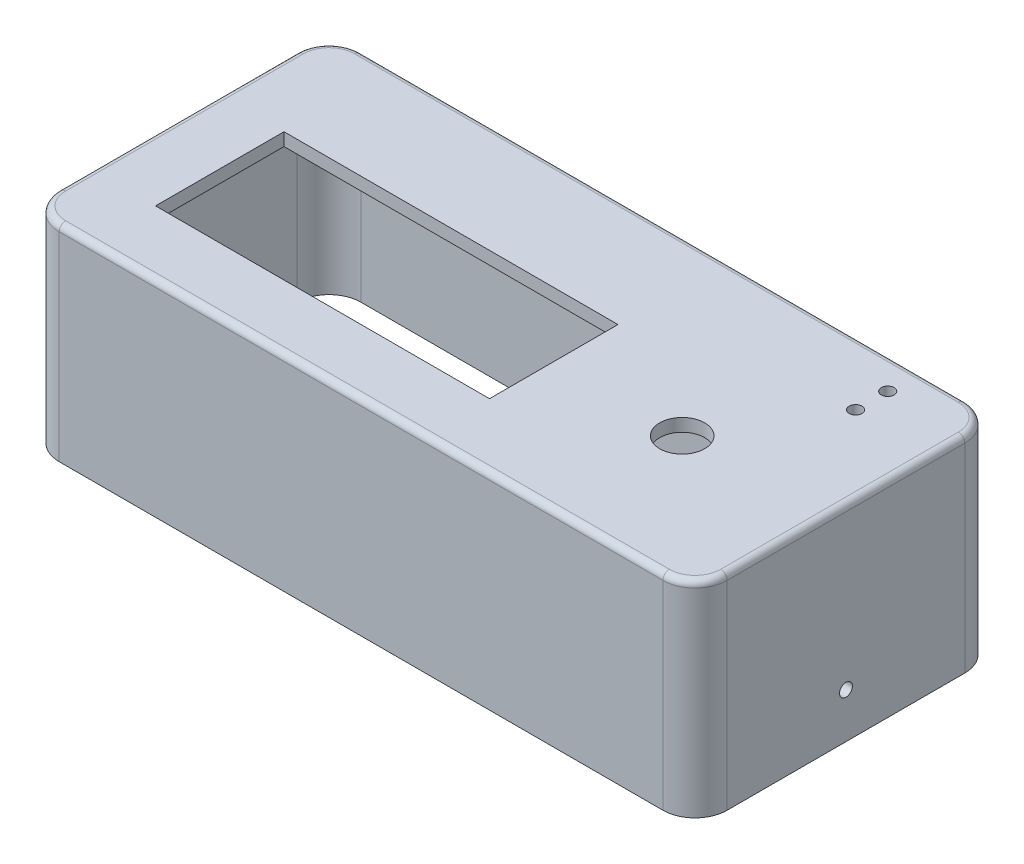
ISO-10303-21;
HEADER;
FILE_DESCRIPTION(('STEP AP214'),'2;1');
FILE_NAME('part.step','',(''),(''),'','','');
FILE_SCHEMA(('AUTOMOTIVE_DESIGN { 1 0 10303 214 1 1 1 1 }'));
ENDSEC;
DATA;
#1=APPLICATION_CONTEXT('core data for automotive mechanical design processes');
#2=APPLICATION_PROTOCOL_DEFINITION('international standard','automotive_design',2000,#1);
#3=PRODUCT_CONTEXT('',#1,'mechanical');
#4=PRODUCT('Part','Part','',(#3));
#5=PRODUCT_RELATED_PRODUCT_CATEGORY('part','',(#4));
#6=PRODUCT_DEFINITION_FORMATION('','',#4);
#7=PRODUCT_DEFINITION_CONTEXT('part definition',#1,'design');
#8=PRODUCT_DEFINITION('design','',#6,#7);
#9=PRODUCT_DEFINITION_SHAPE('','',#8);
#10=(LENGTH_UNIT() NAMED_UNIT(*) SI_UNIT(.MILLI.,.METRE.));
#11=(NAMED_UNIT(*) PLANE_ANGLE_UNIT() SI_UNIT($,.RADIAN.));
#12=(NAMED_UNIT(*) SI_UNIT($,.STERADIAN.) SOLID_ANGLE_UNIT());
#13=UNCERTAINTY_MEASURE_WITH_UNIT(LENGTH_MEASURE(1.E-05),#10,'distance_accuracy_value','');
#14=(GEOMETRIC_REPRESENTATION_CONTEXT(3) GLOBAL_UNCERTAINTY_ASSIGNED_CONTEXT((#13)) GLOBAL_UNIT_ASSIGNED_CONTEXT((#10,
#11,#12)) REPRESENTATION_CONTEXT('',''));
#15=CARTESIAN_POINT('',(0.,0.,0.));
#16=DIRECTION('',(0.,0.,1.));
#17=DIRECTION('',(1.,0.,0.));
#18=AXIS2_PLACEMENT_3D('',#15,#16,#17);
#19=CARTESIAN_POINT('',(0.,-32.,-25.));
#20=DIRECTION('',(0.,0.,1.));
#21=DIRECTION('',(1.,0.,0.));
#22=AXIS2_PLACEMENT_3D('',#19,#20,#21);
#23=PLANE('',#22);
#24=DIRECTION('',(1.,0.,0.));
#25=VECTOR('',#24,1.);
#26=CARTESIAN_POINT('',(0.,-32.,-25.));
#27=LINE('',#26,#25);
#28=CARTESIAN_POINT('',(-29.,-32.,-25.));
#29=VERTEX_POINT('',#28);
#30=CARTESIAN_POINT('',(49.,-32.,-25.));
#31=VERTEX_POINT('',#30);
#32=EDGE_CURVE('E237',#29,#31,#27,.T.);
#33=ORIENTED_EDGE('',*,*,#32,.T.);
#34=DIRECTION('',(0.,1.,0.));
#35=VECTOR('',#34,1.);
#36=CARTESIAN_POINT('',(49.,0.,-25.));
#37=LINE('',#36,#35);
#38=CARTESIAN_POINT('',(49.,-22.,-25.));
#39=VERTEX_POINT('',#38);
#40=EDGE_CURVE('E220',#31,#39,#37,.T.);
#41=ORIENTED_EDGE('',*,*,#40,.T.);
#42=DIRECTION('',(-1.,0.,0.));
#43=VECTOR('',#42,1.);
#44=CARTESIAN_POINT('',(0.,-22.,-25.));
#45=LINE('',#44,#43);
#46=CARTESIAN_POINT('',(61.,-22.,-25.));
#47=VERTEX_POINT('',#46);
#48=EDGE_CURVE('E230',#47,#39,#45,.T.);
#49=ORIENTED_EDGE('',*,*,#48,.F.);
#50=DIRECTION('',(0.,1.,0.));
#51=VECTOR('',#50,1.);
#52=CARTESIAN_POINT('',(61.,-32.,-25.));
#53=LINE('',#52,#51);
#54=CARTESIAN_POINT('',(61.,-2.,-25.));
#55=VERTEX_POINT('',#54);
#56=EDGE_CURVE('E329',#47,#55,#53,.T.);
#57=ORIENTED_EDGE('',*,*,#56,.T.);
#58=DIRECTION('',(1.,0.,0.));
#59=VECTOR('',#58,1.);
#60=CARTESIAN_POINT('',(0.,-2.,-25.));
#61=LINE('',#60,#59);
#62=CARTESIAN_POINT('',(-29.,-2.,-25.));
#63=VERTEX_POINT('',#62);
#64=EDGE_CURVE('E349',#63,#55,#61,.T.);
#65=ORIENTED_EDGE('',*,*,#64,.F.);
#66=DIRECTION('',(0.,1.,0.));
#67=VECTOR('',#66,1.);
#68=CARTESIAN_POINT('',(-29.,-32.,-25.));
#69=LINE('',#68,#67);
#70=EDGE_CURVE('E242',#29,#63,#69,.T.);
#71=ORIENTED_EDGE('',*,*,#70,.F.);
#72=EDGE_LOOP('',(#33,#41,#49,#57,#65,#71));
#73=FACE_BOUND('',#72,.T.);
#74=ADVANCED_FACE('F36',(#73),#23,.T.);
#75=CARTESIAN_POINT('',(0.,-32.,-27.));
#76=DIRECTION('',(0.,0.,1.));
#77=DIRECTION('',(1.,0.,0.));
#78=AXIS2_PLACEMENT_3D('',#75,#76,#77);
#79=PLANE('',#78);
#80=DIRECTION('',(0.,1.,0.));
#81=VECTOR('',#80,1.);
#82=CARTESIAN_POINT('',(49.,-32.,-27.));
#83=LINE('',#82,#81);
#84=CARTESIAN_POINT('',(49.,-32.,-27.));
#85=VERTEX_POINT('',#84);
#86=CARTESIAN_POINT('',(49.,-22.,-27.));
#87=VERTEX_POINT('',#86);
#88=EDGE_CURVE('E667',#85,#87,#83,.T.);
#89=ORIENTED_EDGE('',*,*,#88,.F.);
#90=DIRECTION('',(1.,0.,0.));
#91=VECTOR('',#90,1.);
#92=CARTESIAN_POINT('',(0.,-32.,-27.));
#93=LINE('',#92,#91);
#94=CARTESIAN_POINT('',(-31.,-32.,-27.));
#95=VERTEX_POINT('',#94);
#96=EDGE_CURVE('E239',#95,#85,#93,.T.);
#97=ORIENTED_EDGE('',*,*,#96,.F.);
#98=DIRECTION('',(0.,1.,0.));
#99=VECTOR('',#98,1.);
#100=CARTESIAN_POINT('',(-31.,-32.,-27.));
#101=LINE('',#100,#99);
#102=CARTESIAN_POINT('',(-31.,-1.,-27.));
#103=VERTEX_POINT('',#102);
#104=EDGE_CURVE('E285',#95,#103,#101,.T.);
#105=ORIENTED_EDGE('',*,*,#104,.T.);
#106=DIRECTION('',(1.,0.,0.));
#107=VECTOR('',#106,1.);
#108=CARTESIAN_POINT('',(63.,-1.,-27.));
#109=LINE('',#108,#107);
#110=CARTESIAN_POINT('',(63.,-1.,-27.));
#111=VERTEX_POINT('',#110);
#112=EDGE_CURVE('E427',#103,#111,#109,.T.);
#113=ORIENTED_EDGE('',*,*,#112,.T.);
#114=DIRECTION('',(0.,1.,0.));
#115=VECTOR('',#114,1.);
#116=CARTESIAN_POINT('',(63.,-32.,-27.));
#117=LINE('',#116,#115);
#118=CARTESIAN_POINT('',(63.,-32.,-27.));
#119=VERTEX_POINT('',#118);
#120=EDGE_CURVE('E289',#119,#111,#117,.T.);
#121=ORIENTED_EDGE('',*,*,#120,.F.);
#122=CARTESIAN_POINT('',(61.,-32.,-27.));
#123=VERTEX_POINT('',#122);
#124=EDGE_CURVE('E283',#123,#119,#93,.T.);
#125=ORIENTED_EDGE('',*,*,#124,.F.);
#126=DIRECTION('',(0.,1.,0.));
#127=VECTOR('',#126,1.);
#128=CARTESIAN_POINT('',(61.,-32.,-27.));
#129=LINE('',#128,#127);
#130=CARTESIAN_POINT('',(61.,-22.,-27.));
#131=VERTEX_POINT('',#130);
#132=EDGE_CURVE('E51',#123,#131,#129,.T.);
#133=ORIENTED_EDGE('',*,*,#132,.T.);
#134=DIRECTION('',(-1.,0.,0.));
#135=VECTOR('',#134,1.);
#136=CARTESIAN_POINT('',(0.,-22.,-27.));
#137=LINE('',#136,#135);
#138=EDGE_CURVE('E11',#131,#87,#137,.T.);
#139=ORIENTED_EDGE('',*,*,#138,.T.);
#140=EDGE_LOOP('',(#89,#97,#105,#113,#121,#125,#133,#139));
#141=FACE_BOUND('',#140,.T.);
#142=ADVANCED_FACE('F462',(#141),#79,.F.);
#143=CARTESIAN_POINT('',(0.,-32.,0.));
#144=DIRECTION('',(0.,1.,0.));
#145=DIRECTION('',(0.,0.,1.));
#146=AXIS2_PLACEMENT_3D('',#143,#144,#145);
#147=PLANE('',#146);
#148=DIRECTION('',(0.,0.,-1.));
#149=VECTOR('',#148,1.);
#150=CARTESIAN_POINT('',(49.,-32.,0.));
#151=LINE('',#150,#149);
#152=EDGE_CURVE('E44',#31,#85,#151,.T.);
#153=ORIENTED_EDGE('',*,*,#152,.F.);
#154=ORIENTED_EDGE('',*,*,#32,.F.);
#155=CARTESIAN_POINT('',(-29.,-32.,-20.));
#156=DIRECTION('',(0.,1.,0.));
#157=DIRECTION('',(0.,0.,1.));
#158=AXIS2_PLACEMENT_3D('',#155,#156,#157);
#159=CIRCLE('',#158,5.);
#160=CARTESIAN_POINT('',(-34.,-32.,-20.));
#161=VERTEX_POINT('',#160);
#162=EDGE_CURVE('E245',#29,#161,#159,.T.);
#163=ORIENTED_EDGE('',*,*,#162,.T.);
#164=DIRECTION('',(0.,0.,1.));
#165=VECTOR('',#164,1.);
#166=CARTESIAN_POINT('',(-34.,-32.,0.));
#167=LINE('',#166,#165);
#168=CARTESIAN_POINT('',(-34.,-32.,13.));
#169=VERTEX_POINT('',#168);
#170=EDGE_CURVE('E263',#161,#169,#167,.T.);
#171=ORIENTED_EDGE('',*,*,#170,.T.);
#172=CARTESIAN_POINT('',(-29.,-32.,13.));
#173=DIRECTION('',(0.,1.,0.));
#174=DIRECTION('',(0.,0.,1.));
#175=AXIS2_PLACEMENT_3D('',#172,#173,#174);
#176=CIRCLE('',#175,5.);
#177=CARTESIAN_POINT('',(-28.9999999999999,-32.,18.));
#178=VERTEX_POINT('',#177);
#179=EDGE_CURVE('E261',#169,#178,#176,.T.);
#180=ORIENTED_EDGE('',*,*,#179,.T.);
#181=DIRECTION('',(1.,0.,0.));
#182=VECTOR('',#181,1.);
#183=CARTESIAN_POINT('',(0.,-32.,18.));
#184=LINE('',#183,#182);
#185=CARTESIAN_POINT('',(61.,-32.,18.));
#186=VERTEX_POINT('',#185);
#187=EDGE_CURVE('E259',#178,#186,#184,.T.);
#188=ORIENTED_EDGE('',*,*,#187,.T.);
#189=CARTESIAN_POINT('',(61.,-32.,13.));
#190=DIRECTION('',(0.,1.,0.));
#191=DIRECTION('',(0.,0.,1.));
#192=AXIS2_PLACEMENT_3D('',#189,#190,#191);
#193=CIRCLE('',#192,5.);
#194=CARTESIAN_POINT('',(66.,-32.,13.));
#195=VERTEX_POINT('',#194);
#196=EDGE_CURVE('E256',#195,#186,#193,.F.);
#197=ORIENTED_EDGE('',*,*,#196,.F.);
#198=DIRECTION('',(0.,0.,1.));
#199=VECTOR('',#198,1.);
#200=CARTESIAN_POINT('',(66.,-32.,0.));
#201=LINE('',#200,#199);
#202=CARTESIAN_POINT('',(66.,-32.,-20.));
#203=VERTEX_POINT('',#202);
#204=EDGE_CURVE('E248',#203,#195,#201,.T.);
#205=ORIENTED_EDGE('',*,*,#204,.F.);
#206=CARTESIAN_POINT('',(61.,-32.,-20.));
#207=DIRECTION('',(0.,1.,0.));
#208=DIRECTION('',(0.,0.,1.));
#209=AXIS2_PLACEMENT_3D('',#206,#207,#208);
#210=CIRCLE('',#209,5.);
#211=CARTESIAN_POINT('',(61.,-32.,-25.));
#212=VERTEX_POINT('',#211);
#213=EDGE_CURVE('E244',#203,#212,#210,.T.);
#214=ORIENTED_EDGE('',*,*,#213,.T.);
#215=DIRECTION('',(0.,0.,-1.));
#216=VECTOR('',#215,1.);
#217=CARTESIAN_POINT('',(61.,-32.,0.));
#218=LINE('',#217,#216);
#219=EDGE_CURVE('E240',#212,#123,#218,.T.);
#220=ORIENTED_EDGE('',*,*,#219,.T.);
#221=ORIENTED_EDGE('',*,*,#124,.T.);
#222=CARTESIAN_POINT('',(63.,-32.,-22.));
#223=DIRECTION('',(0.,1.,0.));
#224=DIRECTION('',(0.,0.,1.));
#225=AXIS2_PLACEMENT_3D('',#222,#223,#224);
#226=CIRCLE('',#225,5.);
#227=CARTESIAN_POINT('',(68.,-32.,-22.));
#228=VERTEX_POINT('',#227);
#229=EDGE_CURVE('E280',#228,#119,#226,.T.);
#230=ORIENTED_EDGE('',*,*,#229,.F.);
#231=DIRECTION('',(0.,0.,1.));
#232=VECTOR('',#231,1.);
#233=CARTESIAN_POINT('',(68.,-32.,0.));
#234=LINE('',#233,#232);
#235=CARTESIAN_POINT('',(68.,-32.,15.));
#236=VERTEX_POINT('',#235);
#237=EDGE_CURVE('E278',#228,#236,#234,.T.);
#238=ORIENTED_EDGE('',*,*,#237,.T.);
#239=CARTESIAN_POINT('',(63.,-32.,15.));
#240=DIRECTION('',(0.,1.,0.));
#241=DIRECTION('',(0.,0.,1.));
#242=AXIS2_PLACEMENT_3D('',#239,#240,#241);
#243=CIRCLE('',#242,5.);
#244=CARTESIAN_POINT('',(63.,-32.,20.));
#245=VERTEX_POINT('',#244);
#246=EDGE_CURVE('E276',#236,#245,#243,.F.);
#247=ORIENTED_EDGE('',*,*,#246,.T.);
#248=DIRECTION('',(1.,0.,0.));
#249=VECTOR('',#248,1.);
#250=CARTESIAN_POINT('',(0.,-32.,20.));
#251=LINE('',#250,#249);
#252=CARTESIAN_POINT('',(-30.9999999999999,-32.,20.));
#253=VERTEX_POINT('',#252);
#254=EDGE_CURVE('E273',#253,#245,#251,.T.);
#255=ORIENTED_EDGE('',*,*,#254,.F.);
#256=CARTESIAN_POINT('',(-31.,-32.,15.));
#257=DIRECTION('',(0.,1.,0.));
#258=DIRECTION('',(0.,0.,1.));
#259=AXIS2_PLACEMENT_3D('',#256,#257,#258);
#260=CIRCLE('',#259,5.);
#261=CARTESIAN_POINT('',(-36.,-32.,15.));
#262=VERTEX_POINT('',#261);
#263=EDGE_CURVE('E270',#262,#253,#260,.T.);
#264=ORIENTED_EDGE('',*,*,#263,.F.);
#265=DIRECTION('',(0.,0.,1.));
#266=VECTOR('',#265,1.);
#267=CARTESIAN_POINT('',(-36.,-32.,0.));
#268=LINE('',#267,#266);
#269=CARTESIAN_POINT('',(-36.,-32.,-22.));
#270=VERTEX_POINT('',#269);
#271=EDGE_CURVE('E267',#270,#262,#268,.T.);
#272=ORIENTED_EDGE('',*,*,#271,.F.);
#273=CARTESIAN_POINT('',(-31.,-32.,-22.));
#274=DIRECTION('',(0.,1.,0.));
#275=DIRECTION('',(0.,0.,1.));
#276=AXIS2_PLACEMENT_3D('',#273,#274,#275);
#277=CIRCLE('',#276,5.);
#278=EDGE_CURVE('E265',#270,#95,#277,.F.);
#279=ORIENTED_EDGE('',*,*,#278,.T.);
#280=ORIENTED_EDGE('',*,*,#96,.T.);
#281=EDGE_LOOP('',(#153,#154,#163,#171,#180,#188,#197,#205,#214,#220,#221,#230,#238,#247,#255,
#264,#272,#279,#280));
#282=FACE_BOUND('',#281,.T.);
#283=ADVANCED_FACE('F235',(#282),#147,.F.);
#284=CARTESIAN_POINT('',(0.,-2.,10.));
#285=DIRECTION('',(0.,0.,-1.));
#286=DIRECTION('',(-1.,0.,0.));
#287=AXIS2_PLACEMENT_3D('',#284,#285,#286);
#288=PLANE('',#287);
#289=DIRECTION('',(-1.,0.,0.));
#290=VECTOR('',#289,1.);
#291=CARTESIAN_POINT('',(0.,0.,10.));
#292=LINE('',#291,#290);
#293=CARTESIAN_POINT('',(26.,0.,10.));
#294=VERTEX_POINT('',#293);
#295=CARTESIAN_POINT('',(-26.,0.,10.));
#296=VERTEX_POINT('',#295);
#297=EDGE_CURVE('E378',#294,#296,#292,.T.);
#298=ORIENTED_EDGE('',*,*,#297,.F.);
#299=DIRECTION('',(0.,1.,0.));
#300=VECTOR('',#299,1.);
#301=CARTESIAN_POINT('',(26.,-2.,10.));
#302=LINE('',#301,#300);
#303=CARTESIAN_POINT('',(26.,-2.,10.));
#304=VERTEX_POINT('',#303);
#305=EDGE_CURVE('E392',#304,#294,#302,.T.);
#306=ORIENTED_EDGE('',*,*,#305,.F.);
#307=DIRECTION('',(-1.,0.,0.));
#308=VECTOR('',#307,1.);
#309=CARTESIAN_POINT('',(0.,-2.,10.));
#310=LINE('',#309,#308);
#311=CARTESIAN_POINT('',(-26.,-2.,10.));
#312=VERTEX_POINT('',#311);
#313=EDGE_CURVE('E338',#304,#312,#310,.T.);
#314=ORIENTED_EDGE('',*,*,#313,.T.);
#315=DIRECTION('',(0.,1.,0.));
#316=VECTOR('',#315,1.);
#317=CARTESIAN_POINT('',(-26.,-2.,10.));
#318=LINE('',#317,#316);
#319=EDGE_CURVE('E372',#312,#296,#318,.T.);
#320=ORIENTED_EDGE('',*,*,#319,.T.);
#321=EDGE_LOOP('',(#298,#306,#314,#320));
#322=FACE_BOUND('',#321,.T.);
#323=ADVANCED_FACE('F563',(#322),#288,.T.);
#324=CARTESIAN_POINT('',(26.,-2.,0.));
#325=DIRECTION('',(1.,0.,0.));
#326=DIRECTION('',(0.,0.,-1.));
#327=AXIS2_PLACEMENT_3D('',#324,#325,#326);
#328=PLANE('',#327);
#329=DIRECTION('',(0.,0.,-1.));
#330=VECTOR('',#329,1.);
#331=CARTESIAN_POINT('',(26.,0.,0.));
#332=LINE('',#331,#330);
#333=CARTESIAN_POINT('',(26.,0.,-10.));
#334=VERTEX_POINT('',#333);
#335=EDGE_CURVE('E387',#294,#334,#332,.T.);
#336=ORIENTED_EDGE('',*,*,#335,.T.);
#337=DIRECTION('',(0.,1.,0.));
#338=VECTOR('',#337,1.);
#339=CARTESIAN_POINT('',(26.,-2.,-10.));
#340=LINE('',#339,#338);
#341=CARTESIAN_POINT('',(26.,-2.,-10.));
#342=VERTEX_POINT('',#341);
#343=EDGE_CURVE('E395',#342,#334,#340,.T.);
#344=ORIENTED_EDGE('',*,*,#343,.F.);
#345=DIRECTION('',(0.,0.,-1.));
#346=VECTOR('',#345,1.);
#347=CARTESIAN_POINT('',(26.,-2.,0.));
#348=LINE('',#347,#346);
#349=EDGE_CURVE('E346',#304,#342,#348,.T.);
#350=ORIENTED_EDGE('',*,*,#349,.F.);
#351=ORIENTED_EDGE('',*,*,#305,.T.);
#352=EDGE_LOOP('',(#336,#344,#350,#351));
#353=FACE_BOUND('',#352,.T.);
#354=ADVANCED_FACE('F559',(#353),#328,.F.);
#355=CARTESIAN_POINT('',(0.,-2.,-10.));
#356=DIRECTION('',(0.,0.,-1.));
#357=DIRECTION('',(-1.,0.,0.));
#358=AXIS2_PLACEMENT_3D('',#355,#356,#357);
#359=PLANE('',#358);
#360=DIRECTION('',(-1.,0.,0.));
#361=VECTOR('',#360,1.);
#362=CARTESIAN_POINT('',(0.,0.,-10.));
#363=LINE('',#362,#361);
#364=CARTESIAN_POINT('',(-26.,0.,-9.99999999999999));
#365=VERTEX_POINT('',#364);
#366=EDGE_CURVE('E384',#334,#365,#363,.T.);
#367=ORIENTED_EDGE('',*,*,#366,.T.);
#368=DIRECTION('',(0.,1.,0.));
#369=VECTOR('',#368,1.);
#370=CARTESIAN_POINT('',(-26.,-2.,-9.99999999999999));
#371=LINE('',#370,#369);
#372=CARTESIAN_POINT('',(-26.,-2.,-9.99999999999999));
#373=VERTEX_POINT('',#372);
#374=EDGE_CURVE('E398',#373,#365,#371,.T.);
#375=ORIENTED_EDGE('',*,*,#374,.F.);
#376=DIRECTION('',(-1.,0.,0.));
#377=VECTOR('',#376,1.);
#378=CARTESIAN_POINT('',(0.,-2.,-10.));
#379=LINE('',#378,#377);
#380=EDGE_CURVE('E344',#342,#373,#379,.T.);
#381=ORIENTED_EDGE('',*,*,#380,.F.);
#382=ORIENTED_EDGE('',*,*,#343,.T.);
#383=EDGE_LOOP('',(#367,#375,#381,#382));
#384=FACE_BOUND('',#383,.T.);
#385=ADVANCED_FACE('F562',(#384),#359,.F.);
#386=CARTESIAN_POINT('',(-26.,-2.,0.));
#387=DIRECTION('',(1.,0.,0.));
#388=DIRECTION('',(0.,0.,-1.));
#389=AXIS2_PLACEMENT_3D('',#386,#387,#388);
#390=PLANE('',#389);
#391=DIRECTION('',(0.,0.,-1.));
#392=VECTOR('',#391,1.);
#393=CARTESIAN_POINT('',(-26.,0.,0.));
#394=LINE('',#393,#392);
#395=EDGE_CURVE('E381',#296,#365,#394,.T.);
#396=ORIENTED_EDGE('',*,*,#395,.F.);
#397=ORIENTED_EDGE('',*,*,#319,.F.);
#398=DIRECTION('',(0.,0.,-1.));
#399=VECTOR('',#398,1.);
#400=CARTESIAN_POINT('',(-26.,-2.,0.));
#401=LINE('',#400,#399);
#402=EDGE_CURVE('E341',#312,#373,#401,.T.);
#403=ORIENTED_EDGE('',*,*,#402,.T.);
#404=ORIENTED_EDGE('',*,*,#374,.T.);
#405=EDGE_LOOP('',(#396,#397,#403,#404));
#406=FACE_BOUND('',#405,.T.);
#407=ADVANCED_FACE('F567',(#406),#390,.T.);
#408=CARTESIAN_POINT('',(56.,-2.,-22.));
#409=DIRECTION('',(0.,1.,0.));
#410=DIRECTION('',(0.,0.,1.));
#411=AXIS2_PLACEMENT_3D('',#408,#409,#410);
#412=CYLINDRICAL_SURFACE('',#411,0.999999999999998);
#413=CARTESIAN_POINT('',(56.,-2.,-22.));
#414=DIRECTION('',(0.,1.,0.));
#415=DIRECTION('',(0.,0.,1.));
#416=AXIS2_PLACEMENT_3D('',#413,#414,#415);
#417=CIRCLE('',#416,0.999999999999998);
#418=CARTESIAN_POINT('',(56.,-2.,-21.));
#419=VERTEX_POINT('',#418);
#420=EDGE_CURVE('E334',#419,#419,#417,.T.);
#421=ORIENTED_EDGE('',*,*,#420,.F.);
#422=EDGE_LOOP('',(#421));
#423=FACE_BOUND('',#422,.T.);
#424=CARTESIAN_POINT('',(56.,0.,-22.));
#425=DIRECTION('',(0.,1.,0.));
#426=DIRECTION('',(0.,0.,1.));
#427=AXIS2_PLACEMENT_3D('',#424,#425,#426);
#428=CIRCLE('',#427,0.999999999999998);
#429=CARTESIAN_POINT('',(56.,0.,-21.));
#430=VERTEX_POINT('',#429);
#431=EDGE_CURVE('E375',#430,#430,#428,.T.);
#432=ORIENTED_EDGE('',*,*,#431,.T.);
#433=EDGE_LOOP('',(#432));
#434=FACE_BOUND('',#433,.T.);
#435=ADVANCED_FACE('F571',(#423,#434),#412,.F.);
#436=CARTESIAN_POINT('',(56.,-2.,-17.));
#437=DIRECTION('',(0.,1.,0.));
#438=DIRECTION('',(0.,0.,1.));
#439=AXIS2_PLACEMENT_3D('',#436,#437,#438);
#440=CYLINDRICAL_SURFACE('',#439,0.999999999999998);
#441=CARTESIAN_POINT('',(56.,-2.,-17.));
#442=DIRECTION('',(0.,1.,0.));
#443=DIRECTION('',(0.,0.,1.));
#444=AXIS2_PLACEMENT_3D('',#441,#442,#443);
#445=CIRCLE('',#444,0.999999999999998);
#446=CARTESIAN_POINT('',(56.,-2.,-16.));
#447=VERTEX_POINT('',#446);
#448=EDGE_CURVE('E331',#447,#447,#445,.T.);
#449=ORIENTED_EDGE('',*,*,#448,.F.);
#450=EDGE_LOOP('',(#449));
#451=FACE_BOUND('',#450,.T.);
#452=CARTESIAN_POINT('',(56.,0.,-17.));
#453=DIRECTION('',(0.,1.,0.));
#454=DIRECTION('',(0.,0.,1.));
#455=AXIS2_PLACEMENT_3D('',#452,#453,#454);
#456=CIRCLE('',#455,0.999999999999998);
#457=CARTESIAN_POINT('',(56.,0.,-16.));
#458=VERTEX_POINT('',#457);
#459=EDGE_CURVE('E288',#458,#458,#456,.T.);
#460=ORIENTED_EDGE('',*,*,#459,.T.);
#461=EDGE_LOOP('',(#460));
#462=FACE_BOUND('',#461,.T.);
#463=ADVANCED_FACE('F557',(#451,#462),#440,.F.);
#464=CARTESIAN_POINT('',(46.,-2.,0.));
#465=DIRECTION('',(0.,1.,0.));
#466=DIRECTION('',(0.,0.,1.));
#467=AXIS2_PLACEMENT_3D('',#464,#465,#466);
#468=CYLINDRICAL_SURFACE('',#467,3.5);
#469=CARTESIAN_POINT('',(46.,-2.,0.));
#470=DIRECTION('',(0.,1.,0.));
#471=DIRECTION('',(0.,0.,1.));
#472=AXIS2_PLACEMENT_3D('',#469,#470,#471);
#473=CIRCLE('',#472,3.5);
#474=CARTESIAN_POINT('',(46.,-2.,3.5));
#475=VERTEX_POINT('',#474);
#476=EDGE_CURVE('E369',#475,#475,#473,.T.);
#477=ORIENTED_EDGE('',*,*,#476,.F.);
#478=EDGE_LOOP('',(#477));
#479=FACE_BOUND('',#478,.T.);
#480=CARTESIAN_POINT('',(46.,0.,0.));
#481=DIRECTION('',(0.,1.,0.));
#482=DIRECTION('',(0.,0.,1.));
#483=AXIS2_PLACEMENT_3D('',#480,#481,#482);
#484=CIRCLE('',#483,3.5);
#485=CARTESIAN_POINT('',(46.,0.,3.5));
#486=VERTEX_POINT('',#485);
#487=EDGE_CURVE('E335',#486,#486,#484,.T.);
#488=ORIENTED_EDGE('',*,*,#487,.T.);
#489=EDGE_LOOP('',(#488));
#490=FACE_BOUND('',#489,.T.);
#491=ADVANCED_FACE('F551',(#479,#490),#468,.F.);
#492=CARTESIAN_POINT('',(0.,-2.,0.));
#493=DIRECTION('',(0.,1.,0.));
#494=DIRECTION('',(0.,0.,1.));
#495=AXIS2_PLACEMENT_3D('',#492,#493,#494);
#496=PLANE('',#495);
#497=ORIENTED_EDGE('',*,*,#448,.T.);
#498=EDGE_LOOP('',(#497));
#499=FACE_BOUND('',#498,.T.);
#500=ORIENTED_EDGE('',*,*,#420,.T.);
#501=EDGE_LOOP('',(#500));
#502=FACE_BOUND('',#501,.T.);
#503=ORIENTED_EDGE('',*,*,#313,.F.);
#504=ORIENTED_EDGE('',*,*,#349,.T.);
#505=ORIENTED_EDGE('',*,*,#380,.T.);
#506=ORIENTED_EDGE('',*,*,#402,.F.);
#507=EDGE_LOOP('',(#503,#504,#505,#506));
#508=FACE_BOUND('',#507,.T.);
#509=ORIENTED_EDGE('',*,*,#64,.T.);
#510=CARTESIAN_POINT('',(61.,-2.,-20.));
#511=DIRECTION('',(0.,1.,0.));
#512=DIRECTION('',(0.,0.,1.));
#513=AXIS2_PLACEMENT_3D('',#510,#511,#512);
#514=CIRCLE('',#513,5.);
#515=CARTESIAN_POINT('',(66.,-2.,-20.));
#516=VERTEX_POINT('',#515);
#517=EDGE_CURVE('E366',#516,#55,#514,.T.);
#518=ORIENTED_EDGE('',*,*,#517,.F.);
#519=DIRECTION('',(0.,0.,1.));
#520=VECTOR('',#519,1.);
#521=CARTESIAN_POINT('',(66.,-2.,0.));
#522=LINE('',#521,#520);
#523=CARTESIAN_POINT('',(66.,-2.,13.));
#524=VERTEX_POINT('',#523);
#525=EDGE_CURVE('E363',#516,#524,#522,.T.);
#526=ORIENTED_EDGE('',*,*,#525,.T.);
#527=CARTESIAN_POINT('',(61.,-2.,13.));
#528=DIRECTION('',(0.,1.,0.));
#529=DIRECTION('',(0.,0.,1.));
#530=AXIS2_PLACEMENT_3D('',#527,#528,#529);
#531=CIRCLE('',#530,5.);
#532=CARTESIAN_POINT('',(61.,-2.,18.));
#533=VERTEX_POINT('',#532);
#534=EDGE_CURVE('E360',#524,#533,#531,.F.);
#535=ORIENTED_EDGE('',*,*,#534,.T.);
#536=DIRECTION('',(1.,0.,0.));
#537=VECTOR('',#536,1.);
#538=CARTESIAN_POINT('',(0.,-2.,18.));
#539=LINE('',#538,#537);
#540=CARTESIAN_POINT('',(-28.9999999999999,-2.,18.));
#541=VERTEX_POINT('',#540);
#542=EDGE_CURVE('E358',#541,#533,#539,.T.);
#543=ORIENTED_EDGE('',*,*,#542,.F.);
#544=CARTESIAN_POINT('',(-29.,-2.,13.));
#545=DIRECTION('',(0.,1.,0.));
#546=DIRECTION('',(0.,0.,1.));
#547=AXIS2_PLACEMENT_3D('',#544,#545,#546);
#548=CIRCLE('',#547,5.);
#549=CARTESIAN_POINT('',(-34.,-2.,13.));
#550=VERTEX_POINT('',#549);
#551=EDGE_CURVE('E356',#550,#541,#548,.T.);
#552=ORIENTED_EDGE('',*,*,#551,.F.);
#553=DIRECTION('',(0.,0.,1.));
#554=VECTOR('',#553,1.);
#555=CARTESIAN_POINT('',(-34.,-2.,0.));
#556=LINE('',#555,#554);
#557=CARTESIAN_POINT('',(-34.,-2.,-20.));
#558=VERTEX_POINT('',#557);
#559=EDGE_CURVE('E354',#558,#550,#556,.T.);
#560=ORIENTED_EDGE('',*,*,#559,.F.);
#561=CARTESIAN_POINT('',(-29.,-2.,-20.));
#562=DIRECTION('',(0.,1.,0.));
#563=DIRECTION('',(0.,0.,1.));
#564=AXIS2_PLACEMENT_3D('',#561,#562,#563);
#565=CIRCLE('',#564,5.);
#566=EDGE_CURVE('E352',#63,#558,#565,.T.);
#567=ORIENTED_EDGE('',*,*,#566,.F.);
#568=EDGE_LOOP('',(#509,#518,#526,#535,#543,#552,#560,#567));
#569=FACE_BOUND('',#568,.T.);
#570=ORIENTED_EDGE('',*,*,#476,.T.);
#571=EDGE_LOOP('',(#570));
#572=FACE_BOUND('',#571,.T.);
#573=ADVANCED_FACE('F548',(#499,#502,#508,#569,#572),#496,.F.);
#574=CARTESIAN_POINT('',(0.,0.,0.));
#575=DIRECTION('',(0.,1.,0.));
#576=DIRECTION('',(0.,0.,1.));
#577=AXIS2_PLACEMENT_3D('',#574,#575,#576);
#578=PLANE('',#577);
#579=CARTESIAN_POINT('',(63.,0.,-22.));
#580=DIRECTION('',(0.,1.,0.));
#581=DIRECTION('',(0.,0.,1.));
#582=AXIS2_PLACEMENT_3D('',#579,#580,#581);
#583=CIRCLE('',#582,4.);
#584=CARTESIAN_POINT('',(67.,0.,-22.));
#585=VERTEX_POINT('',#584);
#586=CARTESIAN_POINT('',(63.,0.,-26.));
#587=VERTEX_POINT('',#586);
#588=EDGE_CURVE('E411',#585,#587,#583,.T.);
#589=ORIENTED_EDGE('',*,*,#588,.T.);
#590=DIRECTION('',(1.,0.,0.));
#591=VECTOR('',#590,1.);
#592=CARTESIAN_POINT('',(-31.,0.,-26.));
#593=LINE('',#592,#591);
#594=CARTESIAN_POINT('',(-31.,0.,-26.));
#595=VERTEX_POINT('',#594);
#596=EDGE_CURVE('E415',#587,#595,#593,.F.);
#597=ORIENTED_EDGE('',*,*,#596,.T.);
#598=CARTESIAN_POINT('',(-31.,0.,-22.));
#599=DIRECTION('',(0.,1.,0.));
#600=DIRECTION('',(0.,0.,1.));
#601=AXIS2_PLACEMENT_3D('',#598,#599,#600);
#602=CIRCLE('',#601,4.);
#603=CARTESIAN_POINT('',(-35.,0.,-22.));
#604=VERTEX_POINT('',#603);
#605=EDGE_CURVE('E413',#595,#604,#602,.T.);
#606=ORIENTED_EDGE('',*,*,#605,.T.);
#607=DIRECTION('',(0.,0.,1.));
#608=VECTOR('',#607,1.);
#609=CARTESIAN_POINT('',(-35.,0.,0.));
#610=LINE('',#609,#608);
#611=CARTESIAN_POINT('',(-35.,0.,15.));
#612=VERTEX_POINT('',#611);
#613=EDGE_CURVE('E407',#604,#612,#610,.T.);
#614=ORIENTED_EDGE('',*,*,#613,.T.);
#615=CARTESIAN_POINT('',(-31.,0.,15.));
#616=DIRECTION('',(0.,1.,0.));
#617=DIRECTION('',(0.,0.,1.));
#618=AXIS2_PLACEMENT_3D('',#615,#616,#617);
#619=CIRCLE('',#618,4.);
#620=CARTESIAN_POINT('',(-31.,0.,19.));
#621=VERTEX_POINT('',#620);
#622=EDGE_CURVE('E404',#612,#621,#619,.T.);
#623=ORIENTED_EDGE('',*,*,#622,.T.);
#624=DIRECTION('',(1.,0.,0.));
#625=VECTOR('',#624,1.);
#626=CARTESIAN_POINT('',(0.,0.,19.));
#627=LINE('',#626,#625);
#628=CARTESIAN_POINT('',(63.,0.,19.));
#629=VERTEX_POINT('',#628);
#630=EDGE_CURVE('E394',#621,#629,#627,.T.);
#631=ORIENTED_EDGE('',*,*,#630,.T.);
#632=CARTESIAN_POINT('',(63.,0.,15.));
#633=DIRECTION('',(0.,1.,0.));
#634=DIRECTION('',(0.,0.,1.));
#635=AXIS2_PLACEMENT_3D('',#632,#633,#634);
#636=CIRCLE('',#635,4.);
#637=CARTESIAN_POINT('',(67.,0.,15.));
#638=VERTEX_POINT('',#637);
#639=EDGE_CURVE('E402',#629,#638,#636,.T.);
#640=ORIENTED_EDGE('',*,*,#639,.T.);
#641=DIRECTION('',(0.,0.,1.));
#642=VECTOR('',#641,1.);
#643=CARTESIAN_POINT('',(67.,0.,-22.));
#644=LINE('',#643,#642);
#645=EDGE_CURVE('E409',#638,#585,#644,.F.);
#646=ORIENTED_EDGE('',*,*,#645,.T.);
#647=EDGE_LOOP('',(#589,#597,#606,#614,#623,#631,#640,#646));
#648=FACE_BOUND('',#647,.T.);
#649=ORIENTED_EDGE('',*,*,#459,.F.);
#650=EDGE_LOOP('',(#649));
#651=FACE_BOUND('',#650,.T.);
#652=ORIENTED_EDGE('',*,*,#431,.F.);
#653=EDGE_LOOP('',(#652));
#654=FACE_BOUND('',#653,.T.);
#655=ORIENTED_EDGE('',*,*,#297,.T.);
#656=ORIENTED_EDGE('',*,*,#395,.T.);
#657=ORIENTED_EDGE('',*,*,#366,.F.);
#658=ORIENTED_EDGE('',*,*,#335,.F.);
#659=EDGE_LOOP('',(#655,#656,#657,#658));
#660=FACE_BOUND('',#659,.T.);
#661=ORIENTED_EDGE('',*,*,#487,.F.);
#662=EDGE_LOOP('',(#661));
#663=FACE_BOUND('',#662,.T.);
#664=ADVANCED_FACE('F503',(#648,#651,#654,#660,#663),#578,.T.);
#665=CARTESIAN_POINT('',(-29.,-32.,-20.));
#666=DIRECTION('',(0.,1.,0.));
#667=DIRECTION('',(0.,0.,1.));
#668=AXIS2_PLACEMENT_3D('',#665,#666,#667);
#669=CYLINDRICAL_SURFACE('',#668,5.);
#670=ORIENTED_EDGE('',*,*,#70,.T.);
#671=ORIENTED_EDGE('',*,*,#566,.T.);
#672=DIRECTION('',(0.,1.,0.));
#673=VECTOR('',#672,1.);
#674=CARTESIAN_POINT('',(-34.,-32.,-20.));
#675=LINE('',#674,#673);
#676=EDGE_CURVE('E308',#161,#558,#675,.T.);
#677=ORIENTED_EDGE('',*,*,#676,.F.);
#678=ORIENTED_EDGE('',*,*,#162,.F.);
#679=EDGE_LOOP('',(#670,#671,#677,#678));
#680=FACE_BOUND('',#679,.T.);
#681=ADVANCED_FACE('F543',(#680),#669,.F.);
#682=CARTESIAN_POINT('',(-34.,-32.,0.));
#683=DIRECTION('',(-1.,0.,0.));
#684=DIRECTION('',(0.,0.,1.));
#685=AXIS2_PLACEMENT_3D('',#682,#683,#684);
#686=PLANE('',#685);
#687=CARTESIAN_POINT('',(-34.,-25.,-3.49999999999999));
#688=DIRECTION('',(-1.,0.,0.));
#689=DIRECTION('',(0.,0.,1.));
#690=AXIS2_PLACEMENT_3D('',#687,#688,#689);
#691=CIRCLE('',#690,1.);
#692=CARTESIAN_POINT('',(-34.,-25.,-2.49999999999999));
#693=VERTEX_POINT('',#692);
#694=EDGE_CURVE('E436',#693,#693,#691,.T.);
#695=ORIENTED_EDGE('',*,*,#694,.T.);
#696=EDGE_LOOP('',(#695));
#697=FACE_BOUND('',#696,.T.);
#698=ORIENTED_EDGE('',*,*,#676,.T.);
#699=ORIENTED_EDGE('',*,*,#559,.T.);
#700=DIRECTION('',(0.,1.,0.));
#701=VECTOR('',#700,1.);
#702=CARTESIAN_POINT('',(-34.,-32.,13.));
#703=LINE('',#702,#701);
#704=EDGE_CURVE('E311',#169,#550,#703,.T.);
#705=ORIENTED_EDGE('',*,*,#704,.F.);
#706=ORIENTED_EDGE('',*,*,#170,.F.);
#707=EDGE_LOOP('',(#698,#699,#705,#706));
#708=FACE_BOUND('',#707,.T.);
#709=ADVANCED_FACE('F546',(#697,#708),#686,.F.);
#710=CARTESIAN_POINT('',(-29.,-32.,13.));
#711=DIRECTION('',(0.,1.,0.));
#712=DIRECTION('',(0.,0.,1.));
#713=AXIS2_PLACEMENT_3D('',#710,#711,#712);
#714=CYLINDRICAL_SURFACE('',#713,5.);
#715=ORIENTED_EDGE('',*,*,#704,.T.);
#716=ORIENTED_EDGE('',*,*,#551,.T.);
#717=DIRECTION('',(0.,1.,0.));
#718=VECTOR('',#717,1.);
#719=CARTESIAN_POINT('',(-28.9999999999999,-32.,18.));
#720=LINE('',#719,#718);
#721=EDGE_CURVE('E314',#178,#541,#720,.T.);
#722=ORIENTED_EDGE('',*,*,#721,.F.);
#723=ORIENTED_EDGE('',*,*,#179,.F.);
#724=EDGE_LOOP('',(#715,#716,#722,#723));
#725=FACE_BOUND('',#724,.T.);
#726=ADVANCED_FACE('F620',(#725),#714,.F.);
#727=CARTESIAN_POINT('',(0.,-32.,18.));
#728=DIRECTION('',(0.,0.,1.));
#729=DIRECTION('',(1.,0.,0.));
#730=AXIS2_PLACEMENT_3D('',#727,#728,#729);
#731=PLANE('',#730);
#732=ORIENTED_EDGE('',*,*,#721,.T.);
#733=ORIENTED_EDGE('',*,*,#542,.T.);
#734=DIRECTION('',(0.,1.,0.));
#735=VECTOR('',#734,1.);
#736=CARTESIAN_POINT('',(61.,-32.,18.));
#737=LINE('',#736,#735);
#738=EDGE_CURVE('E317',#186,#533,#737,.T.);
#739=ORIENTED_EDGE('',*,*,#738,.F.);
#740=ORIENTED_EDGE('',*,*,#187,.F.);
#741=EDGE_LOOP('',(#732,#733,#739,#740));
#742=FACE_BOUND('',#741,.T.);
#743=ADVANCED_FACE('F624',(#742),#731,.F.);
#744=CARTESIAN_POINT('',(61.,-32.,13.));
#745=DIRECTION('',(0.,1.,0.));
#746=DIRECTION('',(0.,0.,1.));
#747=AXIS2_PLACEMENT_3D('',#744,#745,#746);
#748=CYLINDRICAL_SURFACE('',#747,5.);
#749=ORIENTED_EDGE('',*,*,#534,.F.);
#750=DIRECTION('',(0.,1.,0.));
#751=VECTOR('',#750,1.);
#752=CARTESIAN_POINT('',(66.,-32.,13.));
#753=LINE('',#752,#751);
#754=EDGE_CURVE('E320',#195,#524,#753,.T.);
#755=ORIENTED_EDGE('',*,*,#754,.F.);
#756=ORIENTED_EDGE('',*,*,#196,.T.);
#757=ORIENTED_EDGE('',*,*,#738,.T.);
#758=EDGE_LOOP('',(#749,#755,#756,#757));
#759=FACE_BOUND('',#758,.T.);
#760=ADVANCED_FACE('F628',(#759),#748,.F.);
#761=CARTESIAN_POINT('',(66.,-32.,0.));
#762=DIRECTION('',(-1.,0.,0.));
#763=DIRECTION('',(0.,0.,1.));
#764=AXIS2_PLACEMENT_3D('',#761,#762,#763);
#765=PLANE('',#764);
#766=CARTESIAN_POINT('',(66.,-25.,-3.49999999999999));
#767=DIRECTION('',(-1.,0.,0.));
#768=DIRECTION('',(0.,0.,1.));
#769=AXIS2_PLACEMENT_3D('',#766,#767,#768);
#770=CIRCLE('',#769,1.);
#771=CARTESIAN_POINT('',(66.,-25.,-2.49999999999999));
#772=VERTEX_POINT('',#771);
#773=EDGE_CURVE('E642',#772,#772,#770,.T.);
#774=ORIENTED_EDGE('',*,*,#773,.F.);
#775=EDGE_LOOP('',(#774));
#776=FACE_BOUND('',#775,.T.);
#777=ORIENTED_EDGE('',*,*,#525,.F.);
#778=DIRECTION('',(0.,1.,0.));
#779=VECTOR('',#778,1.);
#780=CARTESIAN_POINT('',(66.,-32.,-20.));
#781=LINE('',#780,#779);
#782=EDGE_CURVE('E323',#203,#516,#781,.T.);
#783=ORIENTED_EDGE('',*,*,#782,.F.);
#784=ORIENTED_EDGE('',*,*,#204,.T.);
#785=ORIENTED_EDGE('',*,*,#754,.T.);
#786=EDGE_LOOP('',(#777,#783,#784,#785));
#787=FACE_BOUND('',#786,.T.);
#788=ADVANCED_FACE('F631',(#776,#787),#765,.T.);
#789=CARTESIAN_POINT('',(61.,-32.,-20.));
#790=DIRECTION('',(0.,1.,0.));
#791=DIRECTION('',(0.,0.,1.));
#792=AXIS2_PLACEMENT_3D('',#789,#790,#791);
#793=CYLINDRICAL_SURFACE('',#792,5.);
#794=ORIENTED_EDGE('',*,*,#782,.T.);
#795=ORIENTED_EDGE('',*,*,#517,.T.);
#796=ORIENTED_EDGE('',*,*,#56,.F.);
#797=EDGE_CURVE('E326',#212,#47,#53,.T.);
#798=ORIENTED_EDGE('',*,*,#797,.F.);
#799=ORIENTED_EDGE('',*,*,#213,.F.);
#800=EDGE_LOOP('',(#794,#795,#796,#798,#799));
#801=FACE_BOUND('',#800,.T.);
#802=ADVANCED_FACE('F541',(#801),#793,.F.);
#803=CARTESIAN_POINT('',(-31.,-32.,-22.));
#804=DIRECTION('',(0.,1.,0.));
#805=DIRECTION('',(0.,0.,1.));
#806=AXIS2_PLACEMENT_3D('',#803,#804,#805);
#807=CYLINDRICAL_SURFACE('',#806,5.);
#808=DIRECTION('',(0.,1.,0.));
#809=VECTOR('',#808,1.);
#810=CARTESIAN_POINT('',(-36.,-32.,-22.));
#811=LINE('',#810,#809);
#812=CARTESIAN_POINT('',(-36.,-1.,-22.));
#813=VERTEX_POINT('',#812);
#814=EDGE_CURVE('E305',#270,#813,#811,.T.);
#815=ORIENTED_EDGE('',*,*,#814,.T.);
#816=CARTESIAN_POINT('',(-31.,-1.,-22.));
#817=DIRECTION('',(0.,1.,0.));
#818=DIRECTION('',(0.,0.,1.));
#819=AXIS2_PLACEMENT_3D('',#816,#817,#818);
#820=CIRCLE('',#819,5.);
#821=EDGE_CURVE('E420',#813,#103,#820,.F.);
#822=ORIENTED_EDGE('',*,*,#821,.T.);
#823=ORIENTED_EDGE('',*,*,#104,.F.);
#824=ORIENTED_EDGE('',*,*,#278,.F.);
#825=EDGE_LOOP('',(#815,#822,#823,#824));
#826=FACE_BOUND('',#825,.T.);
#827=ADVANCED_FACE('F490',(#826),#807,.T.);
#828=CARTESIAN_POINT('',(63.,-32.,-22.));
#829=DIRECTION('',(0.,1.,0.));
#830=DIRECTION('',(0.,0.,1.));
#831=AXIS2_PLACEMENT_3D('',#828,#829,#830);
#832=CYLINDRICAL_SURFACE('',#831,5.);
#833=ORIENTED_EDGE('',*,*,#120,.T.);
#834=CARTESIAN_POINT('',(63.,-1.,-22.));
#835=DIRECTION('',(0.,1.,0.));
#836=DIRECTION('',(0.,0.,1.));
#837=AXIS2_PLACEMENT_3D('',#834,#835,#836);
#838=CIRCLE('',#837,5.);
#839=CARTESIAN_POINT('',(68.,-1.,-22.));
#840=VERTEX_POINT('',#839);
#841=EDGE_CURVE('E422',#111,#840,#838,.F.);
#842=ORIENTED_EDGE('',*,*,#841,.T.);
#843=DIRECTION('',(0.,1.,0.));
#844=VECTOR('',#843,1.);
#845=CARTESIAN_POINT('',(68.,-32.,-22.));
#846=LINE('',#845,#844);
#847=EDGE_CURVE('E292',#228,#840,#846,.T.);
#848=ORIENTED_EDGE('',*,*,#847,.F.);
#849=ORIENTED_EDGE('',*,*,#229,.T.);
#850=EDGE_LOOP('',(#833,#842,#848,#849));
#851=FACE_BOUND('',#850,.T.);
#852=ADVANCED_FACE('F466',(#851),#832,.T.);
#853=CARTESIAN_POINT('',(68.,-32.,0.));
#854=DIRECTION('',(-1.,0.,0.));
#855=DIRECTION('',(0.,0.,1.));
#856=AXIS2_PLACEMENT_3D('',#853,#854,#855);
#857=PLANE('',#856);
#858=CARTESIAN_POINT('',(68.,-25.,-3.49999999999999));
#859=DIRECTION('',(-1.,0.,0.));
#860=DIRECTION('',(0.,0.,1.));
#861=AXIS2_PLACEMENT_3D('',#858,#859,#860);
#862=CIRCLE('',#861,1.);
#863=CARTESIAN_POINT('',(68.,-25.,-2.49999999999999));
#864=VERTEX_POINT('',#863);
#865=EDGE_CURVE('E672',#864,#864,#862,.T.);
#866=ORIENTED_EDGE('',*,*,#865,.T.);
#867=EDGE_LOOP('',(#866));
#868=FACE_BOUND('',#867,.T.);
#869=ORIENTED_EDGE('',*,*,#847,.T.);
#870=DIRECTION('',(0.,0.,1.));
#871=VECTOR('',#870,1.);
#872=CARTESIAN_POINT('',(68.,-1.,15.));
#873=LINE('',#872,#871);
#874=CARTESIAN_POINT('',(68.,-1.,15.));
#875=VERTEX_POINT('',#874);
#876=EDGE_CURVE('E59',#840,#875,#873,.T.);
#877=ORIENTED_EDGE('',*,*,#876,.T.);
#878=DIRECTION('',(0.,1.,0.));
#879=VECTOR('',#878,1.);
#880=CARTESIAN_POINT('',(68.,-32.,15.));
#881=LINE('',#880,#879);
#882=EDGE_CURVE('E294',#236,#875,#881,.T.);
#883=ORIENTED_EDGE('',*,*,#882,.F.);
#884=ORIENTED_EDGE('',*,*,#237,.F.);
#885=EDGE_LOOP('',(#869,#877,#883,#884));
#886=FACE_BOUND('',#885,.T.);
#887=ADVANCED_FACE('F471',(#868,#886),#857,.F.);
#888=CARTESIAN_POINT('',(63.,-32.,15.));
#889=DIRECTION('',(0.,1.,0.));
#890=DIRECTION('',(0.,0.,1.));
#891=AXIS2_PLACEMENT_3D('',#888,#889,#890);
#892=CYLINDRICAL_SURFACE('',#891,5.);
#893=ORIENTED_EDGE('',*,*,#882,.T.);
#894=CARTESIAN_POINT('',(63.,-1.,15.));
#895=DIRECTION('',(0.,1.,0.));
#896=DIRECTION('',(0.,0.,1.));
#897=AXIS2_PLACEMENT_3D('',#894,#895,#896);
#898=CIRCLE('',#897,5.);
#899=CARTESIAN_POINT('',(63.,-1.,20.));
#900=VERTEX_POINT('',#899);
#901=EDGE_CURVE('E424',#875,#900,#898,.F.);
#902=ORIENTED_EDGE('',*,*,#901,.T.);
#903=DIRECTION('',(0.,1.,0.));
#904=VECTOR('',#903,1.);
#905=CARTESIAN_POINT('',(63.,-32.,20.));
#906=LINE('',#905,#904);
#907=EDGE_CURVE('E296',#245,#900,#906,.T.);
#908=ORIENTED_EDGE('',*,*,#907,.F.);
#909=ORIENTED_EDGE('',*,*,#246,.F.);
#910=EDGE_LOOP('',(#893,#902,#908,#909));
#911=FACE_BOUND('',#910,.T.);
#912=ADVANCED_FACE('F474',(#911),#892,.T.);
#913=CARTESIAN_POINT('',(0.,-32.,20.));
#914=DIRECTION('',(0.,0.,1.));
#915=DIRECTION('',(1.,0.,0.));
#916=AXIS2_PLACEMENT_3D('',#913,#914,#915);
#917=PLANE('',#916);
#918=ORIENTED_EDGE('',*,*,#907,.T.);
#919=DIRECTION('',(1.,0.,0.));
#920=VECTOR('',#919,1.);
#921=CARTESIAN_POINT('',(0.,-1.,20.));
#922=LINE('',#921,#920);
#923=CARTESIAN_POINT('',(-30.9999999999999,-1.,20.));
#924=VERTEX_POINT('',#923);
#925=EDGE_CURVE('E431',#900,#924,#922,.F.);
#926=ORIENTED_EDGE('',*,*,#925,.T.);
#927=DIRECTION('',(0.,1.,0.));
#928=VECTOR('',#927,1.);
#929=CARTESIAN_POINT('',(-30.9999999999999,-32.,20.));
#930=LINE('',#929,#928);
#931=EDGE_CURVE('E299',#253,#924,#930,.T.);
#932=ORIENTED_EDGE('',*,*,#931,.F.);
#933=ORIENTED_EDGE('',*,*,#254,.T.);
#934=EDGE_LOOP('',(#918,#926,#932,#933));
#935=FACE_BOUND('',#934,.T.);
#936=ADVANCED_FACE('F478',(#935),#917,.T.);
#937=CARTESIAN_POINT('',(-31.,-32.,15.));
#938=DIRECTION('',(0.,1.,0.));
#939=DIRECTION('',(0.,0.,1.));
#940=AXIS2_PLACEMENT_3D('',#937,#938,#939);
#941=CYLINDRICAL_SURFACE('',#940,5.);
#942=ORIENTED_EDGE('',*,*,#931,.T.);
#943=CARTESIAN_POINT('',(-31.,-1.,15.));
#944=DIRECTION('',(0.,1.,0.));
#945=DIRECTION('',(0.,0.,1.));
#946=AXIS2_PLACEMENT_3D('',#943,#944,#945);
#947=CIRCLE('',#946,5.);
#948=CARTESIAN_POINT('',(-36.,-1.,15.));
#949=VERTEX_POINT('',#948);
#950=EDGE_CURVE('E417',#924,#949,#947,.F.);
#951=ORIENTED_EDGE('',*,*,#950,.T.);
#952=DIRECTION('',(0.,1.,0.));
#953=VECTOR('',#952,1.);
#954=CARTESIAN_POINT('',(-36.,-32.,15.));
#955=LINE('',#954,#953);
#956=EDGE_CURVE('E302',#262,#949,#955,.T.);
#957=ORIENTED_EDGE('',*,*,#956,.F.);
#958=ORIENTED_EDGE('',*,*,#263,.T.);
#959=EDGE_LOOP('',(#942,#951,#957,#958));
#960=FACE_BOUND('',#959,.T.);
#961=ADVANCED_FACE('F482',(#960),#941,.T.);
#962=CARTESIAN_POINT('',(-36.,-32.,0.));
#963=DIRECTION('',(-1.,0.,0.));
#964=DIRECTION('',(0.,0.,1.));
#965=AXIS2_PLACEMENT_3D('',#962,#963,#964);
#966=PLANE('',#965);
#967=CARTESIAN_POINT('',(-36.,-25.,-3.49999999999999));
#968=DIRECTION('',(1.,0.,0.));
#969=DIRECTION('',(0.,0.,-1.));
#970=AXIS2_PLACEMENT_3D('',#967,#968,#969);
#971=CIRCLE('',#970,1.);
#972=CARTESIAN_POINT('',(-36.,-25.,-4.49999999999999));
#973=VERTEX_POINT('',#972);
#974=EDGE_CURVE('E669',#973,#973,#971,.T.);
#975=ORIENTED_EDGE('',*,*,#974,.T.);
#976=EDGE_LOOP('',(#975));
#977=FACE_BOUND('',#976,.T.);
#978=ORIENTED_EDGE('',*,*,#956,.T.);
#979=DIRECTION('',(0.,0.,1.));
#980=VECTOR('',#979,1.);
#981=CARTESIAN_POINT('',(-36.,-1.,0.));
#982=LINE('',#981,#980);
#983=EDGE_CURVE('E429',#949,#813,#982,.F.);
#984=ORIENTED_EDGE('',*,*,#983,.T.);
#985=ORIENTED_EDGE('',*,*,#814,.F.);
#986=ORIENTED_EDGE('',*,*,#271,.T.);
#987=EDGE_LOOP('',(#978,#984,#985,#986));
#988=FACE_BOUND('',#987,.T.);
#989=ADVANCED_FACE('F485',(#977,#988),#966,.T.);
#990=CARTESIAN_POINT('',(63.,-1.,-22.));
#991=DIRECTION('',(0.,1.,0.));
#992=DIRECTION('',(0.,0.,1.));
#993=AXIS2_PLACEMENT_3D('',#990,#991,#992);
#994=TOROIDAL_SURFACE('',#993,4.,1.);
#995=CARTESIAN_POINT('',(67.,-1.,-22.));
#996=DIRECTION('',(0.,0.,1.));
#997=DIRECTION('',(1.,0.,0.));
#998=AXIS2_PLACEMENT_3D('',#995,#996,#997);
#999=CIRCLE('',#998,1.);
#1000=EDGE_CURVE('E450',#840,#585,#999,.T.);
#1001=ORIENTED_EDGE('',*,*,#1000,.F.);
#1002=ORIENTED_EDGE('',*,*,#841,.F.);
#1003=CARTESIAN_POINT('',(63.,-1.,-26.));
#1004=DIRECTION('',(-1.,0.,0.));
#1005=DIRECTION('',(0.,0.,1.));
#1006=AXIS2_PLACEMENT_3D('',#1003,#1004,#1005);
#1007=CIRCLE('',#1006,1.);
#1008=EDGE_CURVE('E250',#587,#111,#1007,.T.);
#1009=ORIENTED_EDGE('',*,*,#1008,.F.);
#1010=ORIENTED_EDGE('',*,*,#588,.F.);
#1011=EDGE_LOOP('',(#1001,#1002,#1009,#1010));
#1012=FACE_BOUND('',#1011,.T.);
#1013=ADVANCED_FACE('F38',(#1012),#994,.T.);
#1014=CARTESIAN_POINT('',(0.,-1.,-26.));
#1015=DIRECTION('',(-1.,0.,0.));
#1016=DIRECTION('',(0.,0.,1.));
#1017=AXIS2_PLACEMENT_3D('',#1014,#1015,#1016);
#1018=CYLINDRICAL_SURFACE('',#1017,1.);
#1019=ORIENTED_EDGE('',*,*,#1008,.T.);
#1020=ORIENTED_EDGE('',*,*,#112,.F.);
#1021=CARTESIAN_POINT('',(-31.,-1.,-26.));
#1022=DIRECTION('',(-1.,0.,0.));
#1023=DIRECTION('',(0.,0.,1.));
#1024=AXIS2_PLACEMENT_3D('',#1021,#1022,#1023);
#1025=CIRCLE('',#1024,1.);
#1026=EDGE_CURVE('E447',#595,#103,#1025,.T.);
#1027=ORIENTED_EDGE('',*,*,#1026,.F.);
#1028=ORIENTED_EDGE('',*,*,#596,.F.);
#1029=EDGE_LOOP('',(#1019,#1020,#1027,#1028));
#1030=FACE_BOUND('',#1029,.T.);
#1031=ADVANCED_FACE('F494',(#1030),#1018,.T.);
#1032=CARTESIAN_POINT('',(67.,-1.,0.));
#1033=DIRECTION('',(0.,0.,-1.));
#1034=DIRECTION('',(-1.,0.,0.));
#1035=AXIS2_PLACEMENT_3D('',#1032,#1033,#1034);
#1036=CYLINDRICAL_SURFACE('',#1035,1.);
#1037=ORIENTED_EDGE('',*,*,#1000,.T.);
#1038=ORIENTED_EDGE('',*,*,#645,.F.);
#1039=CARTESIAN_POINT('',(67.,-1.,15.));
#1040=DIRECTION('',(0.,0.,1.));
#1041=DIRECTION('',(0.,-1.,0.));
#1042=AXIS2_PLACEMENT_3D('',#1039,#1040,#1041);
#1043=CIRCLE('',#1042,1.);
#1044=EDGE_CURVE('E444',#875,#638,#1043,.T.);
#1045=ORIENTED_EDGE('',*,*,#1044,.F.);
#1046=ORIENTED_EDGE('',*,*,#876,.F.);
#1047=EDGE_LOOP('',(#1037,#1038,#1045,#1046));
#1048=FACE_BOUND('',#1047,.T.);
#1049=ADVANCED_FACE('F511',(#1048),#1036,.T.);
#1050=CARTESIAN_POINT('',(-31.,-1.,-22.));
#1051=DIRECTION('',(0.,1.,0.));
#1052=DIRECTION('',(0.,0.,1.));
#1053=AXIS2_PLACEMENT_3D('',#1050,#1051,#1052);
#1054=TOROIDAL_SURFACE('',#1053,4.,1.);
#1055=ORIENTED_EDGE('',*,*,#1026,.T.);
#1056=ORIENTED_EDGE('',*,*,#821,.F.);
#1057=CARTESIAN_POINT('',(-35.,-1.,-22.));
#1058=DIRECTION('',(0.,0.,1.));
#1059=DIRECTION('',(1.,0.,0.));
#1060=AXIS2_PLACEMENT_3D('',#1057,#1058,#1059);
#1061=CIRCLE('',#1060,1.);
#1062=EDGE_CURVE('E441',#604,#813,#1061,.T.);
#1063=ORIENTED_EDGE('',*,*,#1062,.F.);
#1064=ORIENTED_EDGE('',*,*,#605,.F.);
#1065=EDGE_LOOP('',(#1055,#1056,#1063,#1064));
#1066=FACE_BOUND('',#1065,.T.);
#1067=ADVANCED_FACE('F499',(#1066),#1054,.T.);
#1068=CARTESIAN_POINT('',(63.,-1.,15.));
#1069=DIRECTION('',(0.,1.,0.));
#1070=DIRECTION('',(0.,0.,1.));
#1071=AXIS2_PLACEMENT_3D('',#1068,#1069,#1070);
#1072=TOROIDAL_SURFACE('',#1071,4.,1.);
#1073=ORIENTED_EDGE('',*,*,#1044,.T.);
#1074=ORIENTED_EDGE('',*,*,#639,.F.);
#1075=CARTESIAN_POINT('',(63.,-1.,19.));
#1076=DIRECTION('',(-1.,0.,0.));
#1077=DIRECTION('',(0.,0.,1.));
#1078=AXIS2_PLACEMENT_3D('',#1075,#1076,#1077);
#1079=CIRCLE('',#1078,1.);
#1080=EDGE_CURVE('E438',#900,#629,#1079,.T.);
#1081=ORIENTED_EDGE('',*,*,#1080,.F.);
#1082=ORIENTED_EDGE('',*,*,#901,.F.);
#1083=EDGE_LOOP('',(#1073,#1074,#1081,#1082));
#1084=FACE_BOUND('',#1083,.T.);
#1085=ADVANCED_FACE('F514',(#1084),#1072,.T.);
#1086=CARTESIAN_POINT('',(-35.,-1.,0.));
#1087=DIRECTION('',(0.,0.,1.));
#1088=DIRECTION('',(1.,0.,0.));
#1089=AXIS2_PLACEMENT_3D('',#1086,#1087,#1088);
#1090=CYLINDRICAL_SURFACE('',#1089,1.);
#1091=ORIENTED_EDGE('',*,*,#1062,.T.);
#1092=ORIENTED_EDGE('',*,*,#983,.F.);
#1093=CARTESIAN_POINT('',(-35.,-1.,15.));
#1094=DIRECTION('',(0.,0.,1.));
#1095=DIRECTION('',(1.,0.,0.));
#1096=AXIS2_PLACEMENT_3D('',#1093,#1094,#1095);
#1097=CIRCLE('',#1096,1.);
#1098=EDGE_CURVE('E435',#612,#949,#1097,.T.);
#1099=ORIENTED_EDGE('',*,*,#1098,.F.);
#1100=ORIENTED_EDGE('',*,*,#613,.F.);
#1101=EDGE_LOOP('',(#1091,#1092,#1099,#1100));
#1102=FACE_BOUND('',#1101,.T.);
#1103=ADVANCED_FACE('F524',(#1102),#1090,.T.);
#1104=CARTESIAN_POINT('',(0.,-1.,19.));
#1105=DIRECTION('',(1.,0.,0.));
#1106=DIRECTION('',(0.,0.,-1.));
#1107=AXIS2_PLACEMENT_3D('',#1104,#1105,#1106);
#1108=CYLINDRICAL_SURFACE('',#1107,1.);
#1109=ORIENTED_EDGE('',*,*,#1080,.T.);
#1110=ORIENTED_EDGE('',*,*,#630,.F.);
#1111=CARTESIAN_POINT('',(-30.9999999999999,-1.,19.));
#1112=DIRECTION('',(-1.,0.,0.));
#1113=DIRECTION('',(0.,-1.,0.));
#1114=AXIS2_PLACEMENT_3D('',#1111,#1112,#1113);
#1115=CIRCLE('',#1114,1.);
#1116=EDGE_CURVE('E433',#924,#621,#1115,.T.);
#1117=ORIENTED_EDGE('',*,*,#1116,.F.);
#1118=ORIENTED_EDGE('',*,*,#925,.F.);
#1119=EDGE_LOOP('',(#1109,#1110,#1117,#1118));
#1120=FACE_BOUND('',#1119,.T.);
#1121=ADVANCED_FACE('F519',(#1120),#1108,.T.);
#1122=CARTESIAN_POINT('',(-31.,-1.,15.));
#1123=DIRECTION('',(0.,1.,0.));
#1124=DIRECTION('',(0.,0.,1.));
#1125=AXIS2_PLACEMENT_3D('',#1122,#1123,#1124);
#1126=TOROIDAL_SURFACE('',#1125,4.,1.);
#1127=ORIENTED_EDGE('',*,*,#1098,.T.);
#1128=ORIENTED_EDGE('',*,*,#950,.F.);
#1129=ORIENTED_EDGE('',*,*,#1116,.T.);
#1130=ORIENTED_EDGE('',*,*,#622,.F.);
#1131=EDGE_LOOP('',(#1127,#1128,#1129,#1130));
#1132=FACE_BOUND('',#1131,.T.);
#1133=ADVANCED_FACE('F522',(#1132),#1126,.T.);
#1134=CARTESIAN_POINT('',(-36.,-25.,-3.49999999999999));
#1135=DIRECTION('',(1.,0.,0.));
#1136=DIRECTION('',(0.,0.,-1.));
#1137=AXIS2_PLACEMENT_3D('',#1134,#1135,#1136);
#1138=CYLINDRICAL_SURFACE('',#1137,1.);
#1139=ORIENTED_EDGE('',*,*,#974,.F.);
#1140=EDGE_LOOP('',(#1139));
#1141=FACE_BOUND('',#1140,.T.);
#1142=ORIENTED_EDGE('',*,*,#694,.F.);
#1143=EDGE_LOOP('',(#1142));
#1144=FACE_BOUND('',#1143,.T.);
#1145=ADVANCED_FACE('F583',(#1141,#1144),#1138,.F.);
#1146=ORIENTED_EDGE('',*,*,#773,.T.);
#1147=EDGE_LOOP('',(#1146));
#1148=FACE_BOUND('',#1147,.T.);
#1149=ORIENTED_EDGE('',*,*,#865,.F.);
#1150=EDGE_LOOP('',(#1149));
#1151=FACE_BOUND('',#1150,.T.);
#1152=ADVANCED_FACE('F587',(#1148,#1151),#1138,.F.);
#1153=CARTESIAN_POINT('',(0.,-22.,-35.));
#1154=DIRECTION('',(0.,1.,0.));
#1155=DIRECTION('',(0.,0.,1.));
#1156=AXIS2_PLACEMENT_3D('',#1153,#1154,#1155);
#1157=PLANE('',#1156);
#1158=DIRECTION('',(0.,0.,1.));
#1159=VECTOR('',#1158,1.);
#1160=CARTESIAN_POINT('',(61.,-22.,-35.));
#1161=LINE('',#1160,#1159);
#1162=EDGE_CURVE('E660',#131,#47,#1161,.T.);
#1163=ORIENTED_EDGE('',*,*,#1162,.T.);
#1164=ORIENTED_EDGE('',*,*,#48,.T.);
#1165=DIRECTION('',(0.,0.,1.));
#1166=VECTOR('',#1165,1.);
#1167=CARTESIAN_POINT('',(49.,-22.,-35.));
#1168=LINE('',#1167,#1166);
#1169=EDGE_CURVE('E225',#87,#39,#1168,.T.);
#1170=ORIENTED_EDGE('',*,*,#1169,.F.);
#1171=ORIENTED_EDGE('',*,*,#138,.F.);
#1172=EDGE_LOOP('',(#1163,#1164,#1170,#1171));
#1173=FACE_BOUND('',#1172,.T.);
#1174=ADVANCED_FACE('F593',(#1173),#1157,.F.);
#1175=CARTESIAN_POINT('',(49.,0.,-35.));
#1176=DIRECTION('',(1.,0.,0.));
#1177=DIRECTION('',(0.,0.,-1.));
#1178=AXIS2_PLACEMENT_3D('',#1175,#1176,#1177);
#1179=PLANE('',#1178);
#1180=ORIENTED_EDGE('',*,*,#88,.T.);
#1181=ORIENTED_EDGE('',*,*,#1169,.T.);
#1182=ORIENTED_EDGE('',*,*,#40,.F.);
#1183=ORIENTED_EDGE('',*,*,#152,.T.);
#1184=EDGE_LOOP('',(#1180,#1181,#1182,#1183));
#1185=FACE_BOUND('',#1184,.T.);
#1186=ADVANCED_FACE('F222',(#1185),#1179,.T.);
#1187=CARTESIAN_POINT('',(61.,0.,-35.));
#1188=DIRECTION('',(1.,0.,0.));
#1189=DIRECTION('',(0.,0.,-1.));
#1190=AXIS2_PLACEMENT_3D('',#1187,#1188,#1189);
#1191=PLANE('',#1190);
#1192=ORIENTED_EDGE('',*,*,#219,.F.);
#1193=ORIENTED_EDGE('',*,*,#797,.T.);
#1194=ORIENTED_EDGE('',*,*,#1162,.F.);
#1195=ORIENTED_EDGE('',*,*,#132,.F.);
#1196=EDGE_LOOP('',(#1192,#1193,#1194,#1195));
#1197=FACE_BOUND('',#1196,.T.);
#1198=ADVANCED_FACE('F659',(#1197),#1191,.F.);
#1199=CLOSED_SHELL('',(#74,#142,#283,#323,#354,#385,#407,#435,#463,#491,#573,#664,#681,#709,
#726,#743,#760,#788,#802,#827,#852,#887,#912,#936,#961,#989,#1013,#1031,#1049,#1067,#1085,#1103,
#1121,#1133,#1145,#1152,#1174,#1186,#1198));
#1200=MANIFOLD_SOLID_BREP('B2',#1199);
#1201=ADVANCED_BREP_SHAPE_REPRESENTATION('',(#18,#1200),#14);
#1202=SHAPE_DEFINITION_REPRESENTATION(#9,#1201);
ENDSEC;
END-ISO-10303-21;
